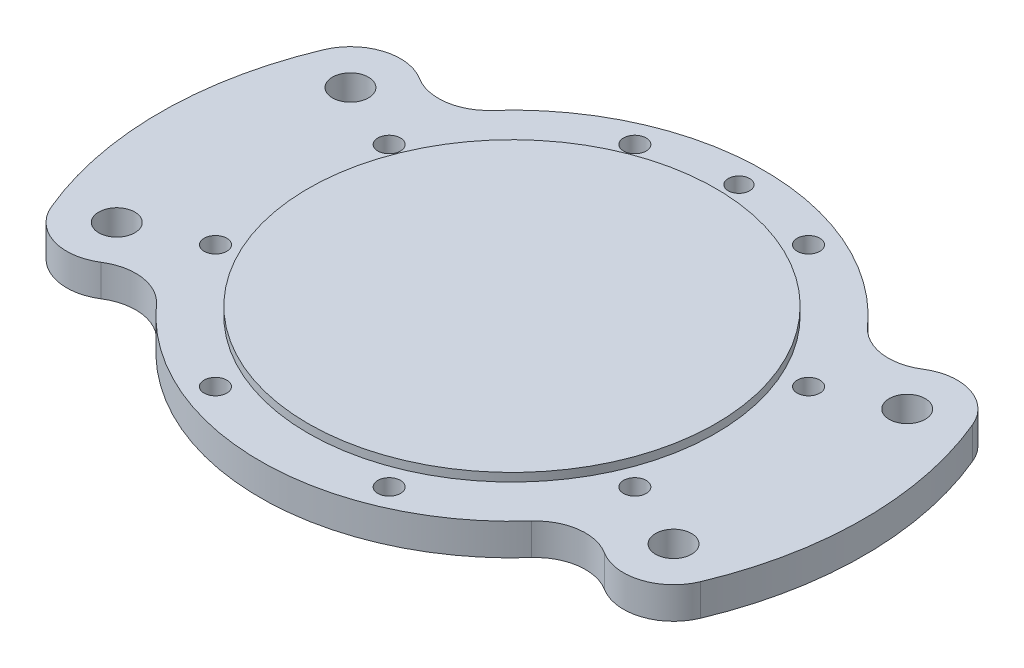
ISO-10303-21;
HEADER;
FILE_DESCRIPTION(('STEP AP214'),'2;1');
FILE_NAME('part.step','',(''),(''),'','','');
FILE_SCHEMA(('AUTOMOTIVE_DESIGN { 1 0 10303 214 1 1 1 1 }'));
ENDSEC;
DATA;
#1=APPLICATION_CONTEXT('core data for automotive mechanical design processes');
#2=APPLICATION_PROTOCOL_DEFINITION('international standard','automotive_design',2000,#1);
#3=PRODUCT_CONTEXT('',#1,'mechanical');
#4=PRODUCT('Part','Part','',(#3));
#5=PRODUCT_RELATED_PRODUCT_CATEGORY('part','',(#4));
#6=PRODUCT_DEFINITION_FORMATION('','',#4);
#7=PRODUCT_DEFINITION_CONTEXT('part definition',#1,'design');
#8=PRODUCT_DEFINITION('design','',#6,#7);
#9=PRODUCT_DEFINITION_SHAPE('','',#8);
#10=(LENGTH_UNIT() NAMED_UNIT(*) SI_UNIT(.MILLI.,.METRE.));
#11=(NAMED_UNIT(*) PLANE_ANGLE_UNIT() SI_UNIT($,.RADIAN.));
#12=(NAMED_UNIT(*) SI_UNIT($,.STERADIAN.) SOLID_ANGLE_UNIT());
#13=UNCERTAINTY_MEASURE_WITH_UNIT(LENGTH_MEASURE(1.E-05),#10,'distance_accuracy_value','');
#14=(GEOMETRIC_REPRESENTATION_CONTEXT(3) GLOBAL_UNCERTAINTY_ASSIGNED_CONTEXT((#13)) GLOBAL_UNIT_ASSIGNED_CONTEXT((#10,
#11,#12)) REPRESENTATION_CONTEXT('',''));
#15=CARTESIAN_POINT('',(0.,0.,0.));
#16=DIRECTION('',(0.,0.,1.));
#17=DIRECTION('',(1.,0.,0.));
#18=AXIS2_PLACEMENT_3D('',#15,#16,#17);
#19=CARTESIAN_POINT('',(0.,6.,0.));
#20=DIRECTION('',(0.,-1.,0.));
#21=DIRECTION('',(0.,0.,-1.));
#22=AXIS2_PLACEMENT_3D('',#19,#20,#21);
#23=CYLINDRICAL_SURFACE('',#22,52.725);
#24=CARTESIAN_POINT('',(0.,4.75,0.));
#25=DIRECTION('',(0.,1.,0.));
#26=DIRECTION('',(0.,0.,1.));
#27=AXIS2_PLACEMENT_3D('',#24,#25,#26);
#28=CIRCLE('',#27,52.725);
#29=CARTESIAN_POINT('',(48.6176681891794,4.75,20.4021558872305));
#30=VERTEX_POINT('',#29);
#31=CARTESIAN_POINT('',(48.6176681891794,4.75,-20.4021558872305));
#32=VERTEX_POINT('',#31);
#33=EDGE_CURVE('E267',#30,#32,#28,.T.);
#34=ORIENTED_EDGE('',*,*,#33,.F.);
#35=DIRECTION('',(0.,-1.,0.));
#36=VECTOR('',#35,1.);
#37=CARTESIAN_POINT('',(48.6176681891794,6.,20.4021558872305));
#38=LINE('',#37,#36);
#39=CARTESIAN_POINT('',(48.6176681891794,0.,20.4021558872305));
#40=VERTEX_POINT('',#39);
#41=EDGE_CURVE('E311',#30,#40,#38,.T.);
#42=ORIENTED_EDGE('',*,*,#41,.T.);
#43=CARTESIAN_POINT('',(0.,0.,0.));
#44=DIRECTION('',(0.,1.,0.));
#45=DIRECTION('',(0.,0.,-1.));
#46=AXIS2_PLACEMENT_3D('',#43,#44,#45);
#47=CIRCLE('',#46,52.725);
#48=CARTESIAN_POINT('',(48.6176681891794,0.,-20.4021558872305));
#49=VERTEX_POINT('',#48);
#50=EDGE_CURVE('E297',#40,#49,#47,.T.);
#51=ORIENTED_EDGE('',*,*,#50,.T.);
#52=DIRECTION('',(0.,-1.,0.));
#53=VECTOR('',#52,1.);
#54=CARTESIAN_POINT('',(48.6176681891794,6.,-20.4021558872305));
#55=LINE('',#54,#53);
#56=EDGE_CURVE('E308',#49,#32,#55,.F.);
#57=ORIENTED_EDGE('',*,*,#56,.T.);
#58=EDGE_LOOP('',(#34,#42,#51,#57));
#59=FACE_BOUND('',#58,.T.);
#60=ADVANCED_FACE('F35',(#59),#23,.T.);
#61=CARTESIAN_POINT('',(0.,6.,0.));
#62=DIRECTION('',(0.,-1.,0.));
#63=DIRECTION('',(0.,0.,-1.));
#64=AXIS2_PLACEMENT_3D('',#61,#62,#63);
#65=CYLINDRICAL_SURFACE('',#64,37.725);
#66=CARTESIAN_POINT('',(0.,4.75,0.));
#67=DIRECTION('',(0.,1.,0.));
#68=DIRECTION('',(0.,0.,1.));
#69=AXIS2_PLACEMENT_3D('',#66,#67,#68);
#70=CIRCLE('',#69,37.725);
#71=CARTESIAN_POINT('',(28.0981033127079,4.75,-25.1728467843506));
#72=VERTEX_POINT('',#71);
#73=CARTESIAN_POINT('',(-28.0981033127079,4.75,-25.1728467843506));
#74=VERTEX_POINT('',#73);
#75=EDGE_CURVE('E141',#72,#74,#70,.T.);
#76=ORIENTED_EDGE('',*,*,#75,.F.);
#77=DIRECTION('',(0.,-1.,0.));
#78=VECTOR('',#77,1.);
#79=CARTESIAN_POINT('',(28.0981033127079,6.,-25.1728467843506));
#80=LINE('',#79,#78);
#81=CARTESIAN_POINT('',(28.0981033127079,0.,-25.1728467843506));
#82=VERTEX_POINT('',#81);
#83=EDGE_CURVE('E158',#72,#82,#80,.T.);
#84=ORIENTED_EDGE('',*,*,#83,.T.);
#85=CARTESIAN_POINT('',(0.,0.,0.));
#86=DIRECTION('',(0.,1.,0.));
#87=DIRECTION('',(0.,0.,-1.));
#88=AXIS2_PLACEMENT_3D('',#85,#86,#87);
#89=CIRCLE('',#88,37.725);
#90=CARTESIAN_POINT('',(-28.0981033127079,0.,-25.1728467843506));
#91=VERTEX_POINT('',#90);
#92=EDGE_CURVE('E300',#82,#91,#89,.T.);
#93=ORIENTED_EDGE('',*,*,#92,.T.);
#94=DIRECTION('',(0.,-1.,0.));
#95=VECTOR('',#94,1.);
#96=CARTESIAN_POINT('',(-28.0981033127079,6.,-25.1728467843506));
#97=LINE('',#96,#95);
#98=EDGE_CURVE('E149',#91,#74,#97,.F.);
#99=ORIENTED_EDGE('',*,*,#98,.T.);
#100=EDGE_LOOP('',(#76,#84,#93,#99));
#101=FACE_BOUND('',#100,.T.);
#102=ADVANCED_FACE('F343',(#101),#65,.T.);
#103=CARTESIAN_POINT('',(0.,6.,0.));
#104=DIRECTION('',(0.,-1.,0.));
#105=DIRECTION('',(0.,0.,-1.));
#106=AXIS2_PLACEMENT_3D('',#103,#104,#105);
#107=CYLINDRICAL_SURFACE('',#106,52.725);
#108=CARTESIAN_POINT('',(0.,4.75,0.));
#109=DIRECTION('',(0.,1.,0.));
#110=DIRECTION('',(0.,0.,1.));
#111=AXIS2_PLACEMENT_3D('',#108,#109,#110);
#112=CIRCLE('',#111,52.725);
#113=CARTESIAN_POINT('',(-48.6176681891794,4.75,-20.4021558872305));
#114=VERTEX_POINT('',#113);
#115=CARTESIAN_POINT('',(-48.6176681891794,4.75,20.4021558872305));
#116=VERTEX_POINT('',#115);
#117=EDGE_CURVE('E126',#114,#116,#112,.T.);
#118=ORIENTED_EDGE('',*,*,#117,.F.);
#119=DIRECTION('',(0.,-1.,0.));
#120=VECTOR('',#119,1.);
#121=CARTESIAN_POINT('',(-48.6176681891794,6.,-20.4021558872305));
#122=LINE('',#121,#120);
#123=CARTESIAN_POINT('',(-48.6176681891794,0.,-20.4021558872305));
#124=VERTEX_POINT('',#123);
#125=EDGE_CURVE('E137',#114,#124,#122,.T.);
#126=ORIENTED_EDGE('',*,*,#125,.T.);
#127=CARTESIAN_POINT('',(0.,0.,0.));
#128=DIRECTION('',(0.,1.,0.));
#129=DIRECTION('',(0.,0.,1.));
#130=AXIS2_PLACEMENT_3D('',#127,#128,#129);
#131=CIRCLE('',#130,52.725);
#132=CARTESIAN_POINT('',(-48.6176681891794,0.,20.4021558872305));
#133=VERTEX_POINT('',#132);
#134=EDGE_CURVE('E303',#124,#133,#131,.T.);
#135=ORIENTED_EDGE('',*,*,#134,.T.);
#136=DIRECTION('',(0.,-1.,0.));
#137=VECTOR('',#136,1.);
#138=CARTESIAN_POINT('',(-48.6176681891794,6.,20.4021558872305));
#139=LINE('',#138,#137);
#140=EDGE_CURVE('E140',#133,#116,#139,.F.);
#141=ORIENTED_EDGE('',*,*,#140,.T.);
#142=EDGE_LOOP('',(#118,#126,#135,#141));
#143=FACE_BOUND('',#142,.T.);
#144=ADVANCED_FACE('F135',(#143),#107,.T.);
#145=CARTESIAN_POINT('',(0.,6.,0.));
#146=DIRECTION('',(0.,-1.,0.));
#147=DIRECTION('',(0.,0.,-1.));
#148=AXIS2_PLACEMENT_3D('',#145,#146,#147);
#149=CYLINDRICAL_SURFACE('',#148,37.725);
#150=CARTESIAN_POINT('',(0.,4.75,0.));
#151=DIRECTION('',(0.,1.,0.));
#152=DIRECTION('',(0.,0.,1.));
#153=AXIS2_PLACEMENT_3D('',#150,#151,#152);
#154=CIRCLE('',#153,37.725);
#155=CARTESIAN_POINT('',(-28.0981033127079,4.75,25.1728467843506));
#156=VERTEX_POINT('',#155);
#157=CARTESIAN_POINT('',(28.0981033127079,4.75,25.1728467843506));
#158=VERTEX_POINT('',#157);
#159=EDGE_CURVE('E260',#156,#158,#154,.T.);
#160=ORIENTED_EDGE('',*,*,#159,.F.);
#161=DIRECTION('',(0.,-1.,0.));
#162=VECTOR('',#161,1.);
#163=CARTESIAN_POINT('',(-28.0981033127079,6.,25.1728467843506));
#164=LINE('',#163,#162);
#165=CARTESIAN_POINT('',(-28.0981033127079,0.,25.1728467843506));
#166=VERTEX_POINT('',#165);
#167=EDGE_CURVE('E152',#156,#166,#164,.T.);
#168=ORIENTED_EDGE('',*,*,#167,.T.);
#169=CARTESIAN_POINT('',(0.,0.,0.));
#170=DIRECTION('',(0.,1.,0.));
#171=DIRECTION('',(0.,0.,1.));
#172=AXIS2_PLACEMENT_3D('',#169,#170,#171);
#173=CIRCLE('',#172,37.725);
#174=CARTESIAN_POINT('',(28.0981033127079,0.,25.1728467843506));
#175=VERTEX_POINT('',#174);
#176=EDGE_CURVE('E305',#166,#175,#173,.T.);
#177=ORIENTED_EDGE('',*,*,#176,.T.);
#178=DIRECTION('',(0.,-1.,0.));
#179=VECTOR('',#178,1.);
#180=CARTESIAN_POINT('',(28.0981033127079,6.,25.1728467843506));
#181=LINE('',#180,#179);
#182=EDGE_CURVE('E147',#175,#158,#181,.F.);
#183=ORIENTED_EDGE('',*,*,#182,.T.);
#184=EDGE_LOOP('',(#160,#168,#177,#183));
#185=FACE_BOUND('',#184,.T.);
#186=ADVANCED_FACE('F324',(#185),#149,.T.);
#187=CARTESIAN_POINT('',(41.7019259147584,6.,-17.5));
#188=DIRECTION('',(0.,-1.,0.));
#189=DIRECTION('',(0.,0.,-1.));
#190=AXIS2_PLACEMENT_3D('',#187,#188,#189);
#191=CYLINDRICAL_SURFACE('',#190,2.7);
#192=CARTESIAN_POINT('',(41.7019259147584,0.,-17.5));
#193=DIRECTION('',(0.,1.,0.));
#194=DIRECTION('',(0.,0.,1.));
#195=AXIS2_PLACEMENT_3D('',#192,#193,#194);
#196=CIRCLE('',#195,2.7);
#197=CARTESIAN_POINT('',(41.7019259147584,0.,-14.8));
#198=VERTEX_POINT('',#197);
#199=EDGE_CURVE('E294',#198,#198,#196,.T.);
#200=ORIENTED_EDGE('',*,*,#199,.F.);
#201=EDGE_LOOP('',(#200));
#202=FACE_BOUND('',#201,.T.);
#203=CARTESIAN_POINT('',(41.7019259147584,4.75,-17.5));
#204=DIRECTION('',(0.,1.,0.));
#205=DIRECTION('',(0.,0.,1.));
#206=AXIS2_PLACEMENT_3D('',#203,#204,#205);
#207=CIRCLE('',#206,2.7);
#208=CARTESIAN_POINT('',(41.7019259147584,4.75,-14.8));
#209=VERTEX_POINT('',#208);
#210=EDGE_CURVE('E281',#209,#209,#207,.T.);
#211=ORIENTED_EDGE('',*,*,#210,.T.);
#212=EDGE_LOOP('',(#211));
#213=FACE_BOUND('',#212,.T.);
#214=ADVANCED_FACE('F385',(#202,#213),#191,.F.);
#215=CARTESIAN_POINT('',(41.7019259147584,6.,17.5));
#216=DIRECTION('',(0.,-1.,0.));
#217=DIRECTION('',(0.,0.,-1.));
#218=AXIS2_PLACEMENT_3D('',#215,#216,#217);
#219=CYLINDRICAL_SURFACE('',#218,2.7);
#220=CARTESIAN_POINT('',(41.7019259147584,0.,17.5));
#221=DIRECTION('',(0.,1.,0.));
#222=DIRECTION('',(0.,0.,1.));
#223=AXIS2_PLACEMENT_3D('',#220,#221,#222);
#224=CIRCLE('',#223,2.7);
#225=CARTESIAN_POINT('',(41.7019259147584,0.,20.2));
#226=VERTEX_POINT('',#225);
#227=EDGE_CURVE('E291',#226,#226,#224,.T.);
#228=ORIENTED_EDGE('',*,*,#227,.F.);
#229=EDGE_LOOP('',(#228));
#230=FACE_BOUND('',#229,.T.);
#231=CARTESIAN_POINT('',(41.7019259147584,4.75,17.5));
#232=DIRECTION('',(0.,1.,0.));
#233=DIRECTION('',(0.,0.,1.));
#234=AXIS2_PLACEMENT_3D('',#231,#232,#233);
#235=CIRCLE('',#234,2.7);
#236=CARTESIAN_POINT('',(41.7019259147584,4.75,20.2));
#237=VERTEX_POINT('',#236);
#238=EDGE_CURVE('E278',#237,#237,#235,.T.);
#239=ORIENTED_EDGE('',*,*,#238,.T.);
#240=EDGE_LOOP('',(#239));
#241=FACE_BOUND('',#240,.T.);
#242=ADVANCED_FACE('F398',(#230,#241),#219,.F.);
#243=CARTESIAN_POINT('',(-41.7019259147584,6.,-17.5));
#244=DIRECTION('',(0.,-1.,0.));
#245=DIRECTION('',(0.,0.,-1.));
#246=AXIS2_PLACEMENT_3D('',#243,#244,#245);
#247=CYLINDRICAL_SURFACE('',#246,2.7);
#248=CARTESIAN_POINT('',(-41.7019259147584,0.,-17.5));
#249=DIRECTION('',(0.,1.,0.));
#250=DIRECTION('',(0.,0.,-1.));
#251=AXIS2_PLACEMENT_3D('',#248,#249,#250);
#252=CIRCLE('',#251,2.7);
#253=CARTESIAN_POINT('',(-41.7019259147584,0.,-20.2));
#254=VERTEX_POINT('',#253);
#255=EDGE_CURVE('E288',#254,#254,#252,.T.);
#256=ORIENTED_EDGE('',*,*,#255,.F.);
#257=EDGE_LOOP('',(#256));
#258=FACE_BOUND('',#257,.T.);
#259=CARTESIAN_POINT('',(-41.7019259147584,4.75,-17.5));
#260=DIRECTION('',(0.,1.,0.));
#261=DIRECTION('',(0.,0.,1.));
#262=AXIS2_PLACEMENT_3D('',#259,#260,#261);
#263=CIRCLE('',#262,2.7);
#264=CARTESIAN_POINT('',(-41.7019259147584,4.75,-14.8));
#265=VERTEX_POINT('',#264);
#266=EDGE_CURVE('E275',#265,#265,#263,.T.);
#267=ORIENTED_EDGE('',*,*,#266,.T.);
#268=EDGE_LOOP('',(#267));
#269=FACE_BOUND('',#268,.T.);
#270=ADVANCED_FACE('F370',(#258,#269),#247,.F.);
#271=CARTESIAN_POINT('',(-41.7019259147584,6.,17.5));
#272=DIRECTION('',(0.,-1.,0.));
#273=DIRECTION('',(0.,0.,-1.));
#274=AXIS2_PLACEMENT_3D('',#271,#272,#273);
#275=CYLINDRICAL_SURFACE('',#274,2.7);
#276=CARTESIAN_POINT('',(-41.7019259147584,0.,17.5));
#277=DIRECTION('',(0.,1.,0.));
#278=DIRECTION('',(0.,0.,-1.));
#279=AXIS2_PLACEMENT_3D('',#276,#277,#278);
#280=CIRCLE('',#279,2.7);
#281=CARTESIAN_POINT('',(-41.7019259147584,0.,14.8));
#282=VERTEX_POINT('',#281);
#283=EDGE_CURVE('E167',#282,#282,#280,.T.);
#284=ORIENTED_EDGE('',*,*,#283,.F.);
#285=EDGE_LOOP('',(#284));
#286=FACE_BOUND('',#285,.T.);
#287=CARTESIAN_POINT('',(-41.7019259147584,4.75,17.5));
#288=DIRECTION('',(0.,1.,0.));
#289=DIRECTION('',(0.,0.,1.));
#290=AXIS2_PLACEMENT_3D('',#287,#288,#289);
#291=CIRCLE('',#290,2.7);
#292=CARTESIAN_POINT('',(-41.7019259147584,4.75,20.2));
#293=VERTEX_POINT('',#292);
#294=EDGE_CURVE('E272',#293,#293,#291,.T.);
#295=ORIENTED_EDGE('',*,*,#294,.T.);
#296=EDGE_LOOP('',(#295));
#297=FACE_BOUND('',#296,.T.);
#298=ADVANCED_FACE('F363',(#286,#297),#275,.F.);
#299=CARTESIAN_POINT('',(33.6842073510197,6.,30.1773888885953));
#300=DIRECTION('',(0.,-1.,0.));
#301=DIRECTION('',(0.,0.,-1.));
#302=AXIS2_PLACEMENT_3D('',#299,#300,#301);
#303=CYLINDRICAL_SURFACE('',#302,7.5);
#304=CARTESIAN_POINT('',(33.6842073510197,4.75,30.1773888885953));
#305=DIRECTION('',(0.,1.,0.));
#306=DIRECTION('',(0.,0.,1.));
#307=AXIS2_PLACEMENT_3D('',#304,#305,#306);
#308=CIRCLE('',#307,7.5);
#309=CARTESIAN_POINT('',(37.693066632889,4.75,23.8386944442976));
#310=VERTEX_POINT('',#309);
#311=EDGE_CURVE('E265',#158,#310,#308,.F.);
#312=ORIENTED_EDGE('',*,*,#311,.F.);
#313=ORIENTED_EDGE('',*,*,#182,.F.);
#314=CARTESIAN_POINT('',(33.6842073510197,0.,30.1773888885953));
#315=DIRECTION('',(0.,-1.,0.));
#316=DIRECTION('',(0.,0.,-1.));
#317=AXIS2_PLACEMENT_3D('',#314,#315,#316);
#318=CIRCLE('',#317,7.5);
#319=CARTESIAN_POINT('',(37.693066632889,0.,23.8386944442976));
#320=VERTEX_POINT('',#319);
#321=EDGE_CURVE('E160',#320,#175,#318,.F.);
#322=ORIENTED_EDGE('',*,*,#321,.F.);
#323=DIRECTION('',(0.,1.,0.));
#324=VECTOR('',#323,1.);
#325=CARTESIAN_POINT('',(37.693066632889,0.,23.8386944442976));
#326=LINE('',#325,#324);
#327=EDGE_CURVE('E165',#310,#320,#326,.F.);
#328=ORIENTED_EDGE('',*,*,#327,.F.);
#329=EDGE_LOOP('',(#312,#313,#322,#328));
#330=FACE_BOUND('',#329,.T.);
#331=ADVANCED_FACE('F361',(#330),#303,.F.);
#332=CARTESIAN_POINT('',(41.7019259147584,6.,17.5));
#333=DIRECTION('',(0.,-1.,0.));
#334=DIRECTION('',(0.,0.,-1.));
#335=AXIS2_PLACEMENT_3D('',#332,#333,#334);
#336=CYLINDRICAL_SURFACE('',#335,7.5);
#337=ORIENTED_EDGE('',*,*,#41,.F.);
#338=CARTESIAN_POINT('',(41.7019259147584,4.75,17.5));
#339=DIRECTION('',(0.,1.,0.));
#340=DIRECTION('',(0.,0.,1.));
#341=AXIS2_PLACEMENT_3D('',#338,#339,#340);
#342=CIRCLE('',#341,7.5);
#343=EDGE_CURVE('E269',#30,#310,#342,.F.);
#344=ORIENTED_EDGE('',*,*,#343,.T.);
#345=ORIENTED_EDGE('',*,*,#327,.T.);
#346=CARTESIAN_POINT('',(41.7019259147584,0.,17.5));
#347=DIRECTION('',(0.,-1.,0.));
#348=DIRECTION('',(0.,0.,-1.));
#349=AXIS2_PLACEMENT_3D('',#346,#347,#348);
#350=CIRCLE('',#349,7.5);
#351=EDGE_CURVE('E318',#40,#320,#350,.T.);
#352=ORIENTED_EDGE('',*,*,#351,.F.);
#353=EDGE_LOOP('',(#337,#344,#345,#352));
#354=FACE_BOUND('',#353,.T.);
#355=ADVANCED_FACE('F357',(#354),#336,.T.);
#356=CARTESIAN_POINT('',(-33.6842073510197,6.,30.1773888885953));
#357=DIRECTION('',(0.,-1.,0.));
#358=DIRECTION('',(0.,0.,-1.));
#359=AXIS2_PLACEMENT_3D('',#356,#357,#358);
#360=CYLINDRICAL_SURFACE('',#359,7.5);
#361=CARTESIAN_POINT('',(-33.6842073510197,4.75,30.1773888885953));
#362=DIRECTION('',(0.,1.,0.));
#363=DIRECTION('',(0.,0.,1.));
#364=AXIS2_PLACEMENT_3D('',#361,#362,#363);
#365=CIRCLE('',#364,7.5);
#366=CARTESIAN_POINT('',(-37.693066632889,4.75,23.8386944442976));
#367=VERTEX_POINT('',#366);
#368=EDGE_CURVE('E258',#367,#156,#365,.F.);
#369=ORIENTED_EDGE('',*,*,#368,.F.);
#370=DIRECTION('',(0.,1.,0.));
#371=VECTOR('',#370,1.);
#372=CARTESIAN_POINT('',(-37.693066632889,6.,23.8386944442976));
#373=LINE('',#372,#371);
#374=CARTESIAN_POINT('',(-37.693066632889,0.,23.8386944442976));
#375=VERTEX_POINT('',#374);
#376=EDGE_CURVE('E168',#375,#367,#373,.T.);
#377=ORIENTED_EDGE('',*,*,#376,.F.);
#378=CARTESIAN_POINT('',(-33.6842073510197,0.,30.1773888885953));
#379=DIRECTION('',(0.,-1.,0.));
#380=DIRECTION('',(0.,0.,-1.));
#381=AXIS2_PLACEMENT_3D('',#378,#379,#380);
#382=CIRCLE('',#381,7.5);
#383=EDGE_CURVE('E162',#166,#375,#382,.F.);
#384=ORIENTED_EDGE('',*,*,#383,.F.);
#385=ORIENTED_EDGE('',*,*,#167,.F.);
#386=EDGE_LOOP('',(#369,#377,#384,#385));
#387=FACE_BOUND('',#386,.T.);
#388=ADVANCED_FACE('F334',(#387),#360,.F.);
#389=CARTESIAN_POINT('',(-41.7019259147584,6.,17.5));
#390=DIRECTION('',(0.,-1.,0.));
#391=DIRECTION('',(0.,0.,-1.));
#392=AXIS2_PLACEMENT_3D('',#389,#390,#391);
#393=CYLINDRICAL_SURFACE('',#392,7.5);
#394=ORIENTED_EDGE('',*,*,#376,.T.);
#395=CARTESIAN_POINT('',(-41.7019259147584,4.75,17.5));
#396=DIRECTION('',(0.,1.,0.));
#397=DIRECTION('',(0.,0.,1.));
#398=AXIS2_PLACEMENT_3D('',#395,#396,#397);
#399=CIRCLE('',#398,7.5);
#400=EDGE_CURVE('E256',#367,#116,#399,.F.);
#401=ORIENTED_EDGE('',*,*,#400,.T.);
#402=ORIENTED_EDGE('',*,*,#140,.F.);
#403=CARTESIAN_POINT('',(-41.7019259147584,0.,17.5));
#404=DIRECTION('',(0.,-1.,0.));
#405=DIRECTION('',(0.,0.,-1.));
#406=AXIS2_PLACEMENT_3D('',#403,#404,#405);
#407=CIRCLE('',#406,7.5);
#408=EDGE_CURVE('E316',#375,#133,#407,.T.);
#409=ORIENTED_EDGE('',*,*,#408,.F.);
#410=EDGE_LOOP('',(#394,#401,#402,#409));
#411=FACE_BOUND('',#410,.T.);
#412=ADVANCED_FACE('F337',(#411),#393,.T.);
#413=CARTESIAN_POINT('',(33.6842073510197,6.,-30.1773888885953));
#414=DIRECTION('',(0.,-1.,0.));
#415=DIRECTION('',(0.,0.,-1.));
#416=AXIS2_PLACEMENT_3D('',#413,#414,#415);
#417=CYLINDRICAL_SURFACE('',#416,7.5);
#418=CARTESIAN_POINT('',(33.6842073510197,4.75,-30.1773888885953));
#419=DIRECTION('',(0.,1.,0.));
#420=DIRECTION('',(0.,0.,1.));
#421=AXIS2_PLACEMENT_3D('',#418,#419,#420);
#422=CIRCLE('',#421,7.5);
#423=CARTESIAN_POINT('',(37.693066632889,4.75,-23.8386944442976));
#424=VERTEX_POINT('',#423);
#425=EDGE_CURVE('E254',#424,#72,#422,.F.);
#426=ORIENTED_EDGE('',*,*,#425,.F.);
#427=DIRECTION('',(0.,1.,0.));
#428=VECTOR('',#427,1.);
#429=CARTESIAN_POINT('',(37.693066632889,6.,-23.8386944442976));
#430=LINE('',#429,#428);
#431=CARTESIAN_POINT('',(37.693066632889,0.,-23.8386944442976));
#432=VERTEX_POINT('',#431);
#433=EDGE_CURVE('E171',#432,#424,#430,.T.);
#434=ORIENTED_EDGE('',*,*,#433,.F.);
#435=CARTESIAN_POINT('',(33.6842073510197,0.,-30.1773888885953));
#436=DIRECTION('',(0.,-1.,0.));
#437=DIRECTION('',(0.,0.,-1.));
#438=AXIS2_PLACEMENT_3D('',#435,#436,#437);
#439=CIRCLE('',#438,7.5);
#440=EDGE_CURVE('E44',#82,#432,#439,.F.);
#441=ORIENTED_EDGE('',*,*,#440,.F.);
#442=ORIENTED_EDGE('',*,*,#83,.F.);
#443=EDGE_LOOP('',(#426,#434,#441,#442));
#444=FACE_BOUND('',#443,.T.);
#445=ADVANCED_FACE('F347',(#444),#417,.F.);
#446=CARTESIAN_POINT('',(41.7019259147584,6.,-17.5));
#447=DIRECTION('',(0.,-1.,0.));
#448=DIRECTION('',(0.,0.,-1.));
#449=AXIS2_PLACEMENT_3D('',#446,#447,#448);
#450=CYLINDRICAL_SURFACE('',#449,7.5);
#451=ORIENTED_EDGE('',*,*,#433,.T.);
#452=CARTESIAN_POINT('',(41.7019259147584,4.75,-17.5));
#453=DIRECTION('',(0.,1.,0.));
#454=DIRECTION('',(0.,0.,1.));
#455=AXIS2_PLACEMENT_3D('',#452,#453,#454);
#456=CIRCLE('',#455,7.5);
#457=EDGE_CURVE('E262',#424,#32,#456,.F.);
#458=ORIENTED_EDGE('',*,*,#457,.T.);
#459=ORIENTED_EDGE('',*,*,#56,.F.);
#460=CARTESIAN_POINT('',(41.7019259147584,0.,-17.5));
#461=DIRECTION('',(0.,-1.,0.));
#462=DIRECTION('',(0.,0.,-1.));
#463=AXIS2_PLACEMENT_3D('',#460,#461,#462);
#464=CIRCLE('',#463,7.5);
#465=EDGE_CURVE('E314',#432,#49,#464,.T.);
#466=ORIENTED_EDGE('',*,*,#465,.F.);
#467=EDGE_LOOP('',(#451,#458,#459,#466));
#468=FACE_BOUND('',#467,.T.);
#469=ADVANCED_FACE('F351',(#468),#450,.T.);
#470=CARTESIAN_POINT('',(-33.6842073510197,6.,-30.1773888885953));
#471=DIRECTION('',(0.,-1.,0.));
#472=DIRECTION('',(0.,0.,-1.));
#473=AXIS2_PLACEMENT_3D('',#470,#471,#472);
#474=CYLINDRICAL_SURFACE('',#473,7.5);
#475=CARTESIAN_POINT('',(-33.6842073510197,4.75,-30.1773888885953));
#476=DIRECTION('',(0.,1.,0.));
#477=DIRECTION('',(0.,0.,1.));
#478=AXIS2_PLACEMENT_3D('',#475,#476,#477);
#479=CIRCLE('',#478,7.5);
#480=CARTESIAN_POINT('',(-37.693066632889,4.75,-23.8386944442976));
#481=VERTEX_POINT('',#480);
#482=EDGE_CURVE('E52',#74,#481,#479,.F.);
#483=ORIENTED_EDGE('',*,*,#482,.F.);
#484=ORIENTED_EDGE('',*,*,#98,.F.);
#485=CARTESIAN_POINT('',(-33.6842073510197,0.,-30.1773888885953));
#486=DIRECTION('',(0.,-1.,0.));
#487=DIRECTION('',(0.,0.,-1.));
#488=AXIS2_PLACEMENT_3D('',#485,#486,#487);
#489=CIRCLE('',#488,7.5);
#490=CARTESIAN_POINT('',(-37.693066632889,0.,-23.8386944442976));
#491=VERTEX_POINT('',#490);
#492=EDGE_CURVE('E12',#491,#91,#489,.F.);
#493=ORIENTED_EDGE('',*,*,#492,.F.);
#494=DIRECTION('',(0.,1.,0.));
#495=VECTOR('',#494,1.);
#496=CARTESIAN_POINT('',(-37.693066632889,0.,-23.8386944442976));
#497=LINE('',#496,#495);
#498=EDGE_CURVE('E174',#481,#491,#497,.F.);
#499=ORIENTED_EDGE('',*,*,#498,.F.);
#500=EDGE_LOOP('',(#483,#484,#493,#499));
#501=FACE_BOUND('',#500,.T.);
#502=ADVANCED_FACE('F37',(#501),#474,.F.);
#503=CARTESIAN_POINT('',(-41.7019259147584,6.,-17.5));
#504=DIRECTION('',(0.,-1.,0.));
#505=DIRECTION('',(0.,0.,-1.));
#506=AXIS2_PLACEMENT_3D('',#503,#504,#505);
#507=CYLINDRICAL_SURFACE('',#506,7.5);
#508=ORIENTED_EDGE('',*,*,#125,.F.);
#509=CARTESIAN_POINT('',(-41.7019259147584,4.75,-17.5));
#510=DIRECTION('',(0.,1.,0.));
#511=DIRECTION('',(0.,0.,1.));
#512=AXIS2_PLACEMENT_3D('',#509,#510,#511);
#513=CIRCLE('',#512,7.5);
#514=EDGE_CURVE('E122',#114,#481,#513,.F.);
#515=ORIENTED_EDGE('',*,*,#514,.T.);
#516=ORIENTED_EDGE('',*,*,#498,.T.);
#517=CARTESIAN_POINT('',(-41.7019259147584,0.,-17.5));
#518=DIRECTION('',(0.,-1.,0.));
#519=DIRECTION('',(0.,0.,-1.));
#520=AXIS2_PLACEMENT_3D('',#517,#518,#519);
#521=CIRCLE('',#520,7.5);
#522=EDGE_CURVE('E145',#124,#491,#521,.T.);
#523=ORIENTED_EDGE('',*,*,#522,.F.);
#524=EDGE_LOOP('',(#508,#515,#516,#523));
#525=FACE_BOUND('',#524,.T.);
#526=ADVANCED_FACE('F143',(#525),#507,.T.);
#527=CARTESIAN_POINT('',(0.,0.,-34.));
#528=DIRECTION('',(0.,1.,0.));
#529=DIRECTION('',(0.,0.,1.));
#530=AXIS2_PLACEMENT_3D('',#527,#528,#529);
#531=CYLINDRICAL_SURFACE('',#530,1.6);
#532=CARTESIAN_POINT('',(0.,0.,-34.));
#533=DIRECTION('',(0.,1.,0.));
#534=DIRECTION('',(0.,0.,1.));
#535=AXIS2_PLACEMENT_3D('',#532,#533,#534);
#536=CIRCLE('',#535,1.6);
#537=CARTESIAN_POINT('',(0.,0.,-32.4));
#538=VERTEX_POINT('',#537);
#539=EDGE_CURVE('E176',#538,#538,#536,.T.);
#540=ORIENTED_EDGE('',*,*,#539,.F.);
#541=EDGE_LOOP('',(#540));
#542=FACE_BOUND('',#541,.T.);
#543=CARTESIAN_POINT('',(0.,4.75,-34.));
#544=DIRECTION('',(0.,1.,0.));
#545=DIRECTION('',(0.,0.,1.));
#546=AXIS2_PLACEMENT_3D('',#543,#544,#545);
#547=CIRCLE('',#546,1.6);
#548=CARTESIAN_POINT('',(0.,4.75,-32.4));
#549=VERTEX_POINT('',#548);
#550=EDGE_CURVE('E131',#549,#549,#547,.F.);
#551=ORIENTED_EDGE('',*,*,#550,.F.);
#552=EDGE_LOOP('',(#551));
#553=FACE_BOUND('',#552,.T.);
#554=ADVANCED_FACE('F388',(#542,#553),#531,.F.);
#555=CARTESIAN_POINT('',(0.,0.,0.));
#556=DIRECTION('',(0.,-1.,0.));
#557=DIRECTION('',(0.,0.,-1.));
#558=AXIS2_PLACEMENT_3D('',#555,#556,#557);
#559=PLANE('',#558);
#560=CARTESIAN_POINT('',(-13.011236700413,0.,31.4119041053838));
#561=DIRECTION('',(0.,-1.,0.));
#562=DIRECTION('',(0.,0.,-1.));
#563=AXIS2_PLACEMENT_3D('',#560,#561,#562);
#564=CIRCLE('',#563,3.15);
#565=CARTESIAN_POINT('',(-13.011236700413,0.,28.2619041053838));
#566=VERTEX_POINT('',#565);
#567=EDGE_CURVE('E484',#566,#566,#564,.T.);
#568=ORIENTED_EDGE('',*,*,#567,.F.);
#569=EDGE_LOOP('',(#568));
#570=FACE_BOUND('',#569,.T.);
#571=CARTESIAN_POINT('',(13.0112367004131,0.,31.4119041053837));
#572=DIRECTION('',(0.,-1.,0.));
#573=DIRECTION('',(0.,0.,-1.));
#574=AXIS2_PLACEMENT_3D('',#571,#572,#573);
#575=CIRCLE('',#574,3.15);
#576=CARTESIAN_POINT('',(13.0112367004131,0.,28.2619041053837));
#577=VERTEX_POINT('',#576);
#578=EDGE_CURVE('E218',#577,#577,#575,.T.);
#579=ORIENTED_EDGE('',*,*,#578,.F.);
#580=EDGE_LOOP('',(#579));
#581=FACE_BOUND('',#580,.T.);
#582=CARTESIAN_POINT('',(31.4119041053838,0.,13.011236700413));
#583=DIRECTION('',(0.,-1.,0.));
#584=DIRECTION('',(0.,0.,-1.));
#585=AXIS2_PLACEMENT_3D('',#582,#583,#584);
#586=CIRCLE('',#585,3.15);
#587=CARTESIAN_POINT('',(31.4119041053838,0.,9.86123670041302));
#588=VERTEX_POINT('',#587);
#589=EDGE_CURVE('E211',#588,#588,#586,.T.);
#590=ORIENTED_EDGE('',*,*,#589,.F.);
#591=EDGE_LOOP('',(#590));
#592=FACE_BOUND('',#591,.T.);
#593=CARTESIAN_POINT('',(31.4119041053837,0.,-13.0112367004131));
#594=DIRECTION('',(0.,-1.,0.));
#595=DIRECTION('',(0.,0.,-1.));
#596=AXIS2_PLACEMENT_3D('',#593,#594,#595);
#597=CIRCLE('',#596,3.15);
#598=CARTESIAN_POINT('',(31.4119041053837,0.,-16.1612367004131));
#599=VERTEX_POINT('',#598);
#600=EDGE_CURVE('E207',#599,#599,#597,.T.);
#601=ORIENTED_EDGE('',*,*,#600,.F.);
#602=EDGE_LOOP('',(#601));
#603=FACE_BOUND('',#602,.T.);
#604=CARTESIAN_POINT('',(13.011236700413,0.,-31.4119041053838));
#605=DIRECTION('',(0.,-1.,0.));
#606=DIRECTION('',(0.,0.,-1.));
#607=AXIS2_PLACEMENT_3D('',#604,#605,#606);
#608=CIRCLE('',#607,3.15);
#609=CARTESIAN_POINT('',(13.011236700413,0.,-34.5619041053838));
#610=VERTEX_POINT('',#609);
#611=EDGE_CURVE('E203',#610,#610,#608,.T.);
#612=ORIENTED_EDGE('',*,*,#611,.F.);
#613=EDGE_LOOP('',(#612));
#614=FACE_BOUND('',#613,.T.);
#615=CARTESIAN_POINT('',(-13.0112367004131,0.,-31.4119041053837));
#616=DIRECTION('',(0.,-1.,0.));
#617=DIRECTION('',(0.,0.,-1.));
#618=AXIS2_PLACEMENT_3D('',#615,#616,#617);
#619=CIRCLE('',#618,3.15);
#620=CARTESIAN_POINT('',(-13.0112367004131,0.,-34.5619041053837));
#621=VERTEX_POINT('',#620);
#622=EDGE_CURVE('E198',#621,#621,#619,.T.);
#623=ORIENTED_EDGE('',*,*,#622,.F.);
#624=EDGE_LOOP('',(#623));
#625=FACE_BOUND('',#624,.T.);
#626=CARTESIAN_POINT('',(-31.4119041053838,0.,-13.011236700413));
#627=DIRECTION('',(0.,-1.,0.));
#628=DIRECTION('',(0.,0.,-1.));
#629=AXIS2_PLACEMENT_3D('',#626,#627,#628);
#630=CIRCLE('',#629,3.15);
#631=CARTESIAN_POINT('',(-31.4119041053838,0.,-16.161236700413));
#632=VERTEX_POINT('',#631);
#633=EDGE_CURVE('E193',#632,#632,#630,.T.);
#634=ORIENTED_EDGE('',*,*,#633,.F.);
#635=EDGE_LOOP('',(#634));
#636=FACE_BOUND('',#635,.T.);
#637=CARTESIAN_POINT('',(-31.4119041053837,0.,13.0112367004131));
#638=DIRECTION('',(0.,-1.,0.));
#639=DIRECTION('',(0.,0.,-1.));
#640=AXIS2_PLACEMENT_3D('',#637,#638,#639);
#641=CIRCLE('',#640,3.15);
#642=CARTESIAN_POINT('',(-31.4119041053837,0.,9.86123670041309));
#643=VERTEX_POINT('',#642);
#644=EDGE_CURVE('E188',#643,#643,#641,.T.);
#645=ORIENTED_EDGE('',*,*,#644,.F.);
#646=EDGE_LOOP('',(#645));
#647=FACE_BOUND('',#646,.T.);
#648=ORIENTED_EDGE('',*,*,#539,.T.);
#649=EDGE_LOOP('',(#648));
#650=FACE_BOUND('',#649,.T.);
#651=ORIENTED_EDGE('',*,*,#255,.T.);
#652=EDGE_LOOP('',(#651));
#653=FACE_BOUND('',#652,.T.);
#654=ORIENTED_EDGE('',*,*,#50,.F.);
#655=ORIENTED_EDGE('',*,*,#351,.T.);
#656=ORIENTED_EDGE('',*,*,#321,.T.);
#657=ORIENTED_EDGE('',*,*,#176,.F.);
#658=ORIENTED_EDGE('',*,*,#383,.T.);
#659=ORIENTED_EDGE('',*,*,#408,.T.);
#660=ORIENTED_EDGE('',*,*,#134,.F.);
#661=ORIENTED_EDGE('',*,*,#522,.T.);
#662=ORIENTED_EDGE('',*,*,#492,.T.);
#663=ORIENTED_EDGE('',*,*,#92,.F.);
#664=ORIENTED_EDGE('',*,*,#440,.T.);
#665=ORIENTED_EDGE('',*,*,#465,.T.);
#666=EDGE_LOOP('',(#654,#655,#656,#657,#658,#659,#660,#661,#662,#663,#664,#665));
#667=FACE_BOUND('',#666,.T.);
#668=ORIENTED_EDGE('',*,*,#199,.T.);
#669=EDGE_LOOP('',(#668));
#670=FACE_BOUND('',#669,.T.);
#671=ORIENTED_EDGE('',*,*,#227,.T.);
#672=EDGE_LOOP('',(#671));
#673=FACE_BOUND('',#672,.T.);
#674=ORIENTED_EDGE('',*,*,#283,.T.);
#675=EDGE_LOOP('',(#674));
#676=FACE_BOUND('',#675,.T.);
#677=ADVANCED_FACE('F330',(#570,#581,#592,#603,#614,#625,#636,#647,#650,#653,#667,#670,#673,
#676),#559,.T.);
#678=CARTESIAN_POINT('',(0.,4.75,0.));
#679=DIRECTION('',(0.,1.,0.));
#680=DIRECTION('',(0.,0.,1.));
#681=AXIS2_PLACEMENT_3D('',#678,#679,#680);
#682=PLANE('',#681);
#683=CARTESIAN_POINT('',(-13.011236700413,4.75,31.4119041053838));
#684=DIRECTION('',(0.,1.,0.));
#685=DIRECTION('',(0.,0.,1.));
#686=AXIS2_PLACEMENT_3D('',#683,#684,#685);
#687=CIRCLE('',#686,1.7);
#688=CARTESIAN_POINT('',(-13.011236700413,4.75,33.1119041053838));
#689=VERTEX_POINT('',#688);
#690=EDGE_CURVE('E39',#689,#689,#687,.T.);
#691=ORIENTED_EDGE('',*,*,#690,.F.);
#692=EDGE_LOOP('',(#691));
#693=FACE_BOUND('',#692,.T.);
#694=CARTESIAN_POINT('',(13.0112367004131,4.75,31.4119041053837));
#695=DIRECTION('',(0.,1.,0.));
#696=DIRECTION('',(0.,0.,1.));
#697=AXIS2_PLACEMENT_3D('',#694,#695,#696);
#698=CIRCLE('',#697,1.7);
#699=CARTESIAN_POINT('',(13.0112367004131,4.75,33.1119041053837));
#700=VERTEX_POINT('',#699);
#701=EDGE_CURVE('E209',#700,#700,#698,.T.);
#702=ORIENTED_EDGE('',*,*,#701,.F.);
#703=EDGE_LOOP('',(#702));
#704=FACE_BOUND('',#703,.T.);
#705=CARTESIAN_POINT('',(31.4119041053838,4.75,13.011236700413));
#706=DIRECTION('',(0.,1.,0.));
#707=DIRECTION('',(0.,0.,1.));
#708=AXIS2_PLACEMENT_3D('',#705,#706,#707);
#709=CIRCLE('',#708,1.7);
#710=CARTESIAN_POINT('',(31.4119041053838,4.75,14.711236700413));
#711=VERTEX_POINT('',#710);
#712=EDGE_CURVE('E205',#711,#711,#709,.T.);
#713=ORIENTED_EDGE('',*,*,#712,.F.);
#714=EDGE_LOOP('',(#713));
#715=FACE_BOUND('',#714,.T.);
#716=CARTESIAN_POINT('',(31.4119041053837,4.75,-13.0112367004131));
#717=DIRECTION('',(0.,1.,0.));
#718=DIRECTION('',(0.,0.,1.));
#719=AXIS2_PLACEMENT_3D('',#716,#717,#718);
#720=CIRCLE('',#719,1.7);
#721=CARTESIAN_POINT('',(31.4119041053837,4.75,-11.3112367004131));
#722=VERTEX_POINT('',#721);
#723=EDGE_CURVE('E200',#722,#722,#720,.T.);
#724=ORIENTED_EDGE('',*,*,#723,.F.);
#725=EDGE_LOOP('',(#724));
#726=FACE_BOUND('',#725,.T.);
#727=CARTESIAN_POINT('',(13.011236700413,4.75,-31.4119041053838));
#728=DIRECTION('',(0.,1.,0.));
#729=DIRECTION('',(0.,0.,1.));
#730=AXIS2_PLACEMENT_3D('',#727,#728,#729);
#731=CIRCLE('',#730,1.7);
#732=CARTESIAN_POINT('',(13.011236700413,4.75,-29.7119041053838));
#733=VERTEX_POINT('',#732);
#734=EDGE_CURVE('E195',#733,#733,#731,.T.);
#735=ORIENTED_EDGE('',*,*,#734,.F.);
#736=EDGE_LOOP('',(#735));
#737=FACE_BOUND('',#736,.T.);
#738=CARTESIAN_POINT('',(-13.0112367004131,4.75,-31.4119041053837));
#739=DIRECTION('',(0.,1.,0.));
#740=DIRECTION('',(0.,0.,1.));
#741=AXIS2_PLACEMENT_3D('',#738,#739,#740);
#742=CIRCLE('',#741,1.7);
#743=CARTESIAN_POINT('',(-13.0112367004131,4.75,-29.7119041053837));
#744=VERTEX_POINT('',#743);
#745=EDGE_CURVE('E190',#744,#744,#742,.T.);
#746=ORIENTED_EDGE('',*,*,#745,.F.);
#747=EDGE_LOOP('',(#746));
#748=FACE_BOUND('',#747,.T.);
#749=CARTESIAN_POINT('',(-31.4119041053838,4.75,-13.011236700413));
#750=DIRECTION('',(0.,1.,0.));
#751=DIRECTION('',(0.,0.,1.));
#752=AXIS2_PLACEMENT_3D('',#749,#750,#751);
#753=CIRCLE('',#752,1.7);
#754=CARTESIAN_POINT('',(-31.4119041053838,4.75,-11.311236700413));
#755=VERTEX_POINT('',#754);
#756=EDGE_CURVE('E185',#755,#755,#753,.T.);
#757=ORIENTED_EDGE('',*,*,#756,.F.);
#758=EDGE_LOOP('',(#757));
#759=FACE_BOUND('',#758,.T.);
#760=CARTESIAN_POINT('',(-31.4119041053837,4.75,13.0112367004131));
#761=DIRECTION('',(0.,1.,0.));
#762=DIRECTION('',(0.,0.,1.));
#763=AXIS2_PLACEMENT_3D('',#760,#761,#762);
#764=CIRCLE('',#763,1.7);
#765=CARTESIAN_POINT('',(-31.4119041053837,4.75,14.7112367004131));
#766=VERTEX_POINT('',#765);
#767=EDGE_CURVE('E180',#766,#766,#764,.T.);
#768=ORIENTED_EDGE('',*,*,#767,.F.);
#769=EDGE_LOOP('',(#768));
#770=FACE_BOUND('',#769,.T.);
#771=ORIENTED_EDGE('',*,*,#210,.F.);
#772=EDGE_LOOP('',(#771));
#773=FACE_BOUND('',#772,.T.);
#774=ORIENTED_EDGE('',*,*,#238,.F.);
#775=EDGE_LOOP('',(#774));
#776=FACE_BOUND('',#775,.T.);
#777=ORIENTED_EDGE('',*,*,#266,.F.);
#778=EDGE_LOOP('',(#777));
#779=FACE_BOUND('',#778,.T.);
#780=ORIENTED_EDGE('',*,*,#294,.F.);
#781=EDGE_LOOP('',(#780));
#782=FACE_BOUND('',#781,.T.);
#783=ORIENTED_EDGE('',*,*,#33,.T.);
#784=ORIENTED_EDGE('',*,*,#457,.F.);
#785=ORIENTED_EDGE('',*,*,#425,.T.);
#786=ORIENTED_EDGE('',*,*,#75,.T.);
#787=ORIENTED_EDGE('',*,*,#482,.T.);
#788=ORIENTED_EDGE('',*,*,#514,.F.);
#789=ORIENTED_EDGE('',*,*,#117,.T.);
#790=ORIENTED_EDGE('',*,*,#400,.F.);
#791=ORIENTED_EDGE('',*,*,#368,.T.);
#792=ORIENTED_EDGE('',*,*,#159,.T.);
#793=ORIENTED_EDGE('',*,*,#311,.T.);
#794=ORIENTED_EDGE('',*,*,#343,.F.);
#795=EDGE_LOOP('',(#783,#784,#785,#786,#787,#788,#789,#790,#791,#792,#793,#794));
#796=FACE_BOUND('',#795,.T.);
#797=CARTESIAN_POINT('',(0.,4.75,0.));
#798=DIRECTION('',(0.,1.,0.));
#799=DIRECTION('',(0.,0.,1.));
#800=AXIS2_PLACEMENT_3D('',#797,#798,#799);
#801=CIRCLE('',#800,30.525);
#802=CARTESIAN_POINT('',(0.,4.75,30.525));
#803=VERTEX_POINT('',#802);
#804=EDGE_CURVE('E179',#803,#803,#801,.T.);
#805=ORIENTED_EDGE('',*,*,#804,.F.);
#806=EDGE_LOOP('',(#805));
#807=FACE_BOUND('',#806,.T.);
#808=ORIENTED_EDGE('',*,*,#550,.T.);
#809=EDGE_LOOP('',(#808));
#810=FACE_BOUND('',#809,.T.);
#811=ADVANCED_FACE('F124',(#693,#704,#715,#726,#737,#748,#759,#770,#773,#776,#779,#782,#796,
#807,#810),#682,.T.);
#812=CARTESIAN_POINT('',(0.,4.75,0.));
#813=DIRECTION('',(0.,1.,0.));
#814=DIRECTION('',(0.,0.,1.));
#815=AXIS2_PLACEMENT_3D('',#812,#813,#814);
#816=CYLINDRICAL_SURFACE('',#815,30.525);
#817=ORIENTED_EDGE('',*,*,#804,.T.);
#818=EDGE_LOOP('',(#817));
#819=FACE_BOUND('',#818,.T.);
#820=CARTESIAN_POINT('',(0.,6.,0.));
#821=DIRECTION('',(0.,1.,0.));
#822=DIRECTION('',(0.,0.,1.));
#823=AXIS2_PLACEMENT_3D('',#820,#821,#822);
#824=CIRCLE('',#823,30.525);
#825=CARTESIAN_POINT('',(0.,6.,30.525));
#826=VERTEX_POINT('',#825);
#827=EDGE_CURVE('E183',#826,#826,#824,.T.);
#828=ORIENTED_EDGE('',*,*,#827,.F.);
#829=EDGE_LOOP('',(#828));
#830=FACE_BOUND('',#829,.T.);
#831=ADVANCED_FACE('F394',(#819,#830),#816,.T.);
#832=CARTESIAN_POINT('',(0.,6.,0.));
#833=DIRECTION('',(0.,-1.,0.));
#834=DIRECTION('',(0.,0.,-1.));
#835=AXIS2_PLACEMENT_3D('',#832,#833,#834);
#836=PLANE('',#835);
#837=ORIENTED_EDGE('',*,*,#827,.T.);
#838=EDGE_LOOP('',(#837));
#839=FACE_BOUND('',#838,.T.);
#840=ADVANCED_FACE('F390',(#839),#836,.F.);
#841=CARTESIAN_POINT('',(-31.4119041053837,0.,13.0112367004131));
#842=DIRECTION('',(0.,-1.,0.));
#843=DIRECTION('',(0.,0.,-1.));
#844=AXIS2_PLACEMENT_3D('',#841,#842,#843);
#845=CYLINDRICAL_SURFACE('',#844,1.7);
#846=ORIENTED_EDGE('',*,*,#767,.T.);
#847=EDGE_LOOP('',(#846));
#848=FACE_BOUND('',#847,.T.);
#849=CARTESIAN_POINT('',(-31.4119041053837,1.45,13.0112367004131));
#850=DIRECTION('',(0.,-1.,0.));
#851=DIRECTION('',(0.,0.,-1.));
#852=AXIS2_PLACEMENT_3D('',#849,#850,#851);
#853=CIRCLE('',#852,1.7);
#854=CARTESIAN_POINT('',(-31.4119041053837,1.45,11.3112367004131));
#855=VERTEX_POINT('',#854);
#856=EDGE_CURVE('E184',#855,#855,#853,.T.);
#857=ORIENTED_EDGE('',*,*,#856,.T.);
#858=EDGE_LOOP('',(#857));
#859=FACE_BOUND('',#858,.T.);
#860=ADVANCED_FACE('F393',(#848,#859),#845,.F.);
#861=CARTESIAN_POINT('',(-31.4119041053837,0.,13.0112367004131));
#862=DIRECTION('',(0.,-1.,0.));
#863=DIRECTION('',(0.,0.,-1.));
#864=AXIS2_PLACEMENT_3D('',#861,#862,#863);
#865=CONICAL_SURFACE('',#864,3.15,0.785398163397447);
#866=ORIENTED_EDGE('',*,*,#856,.F.);
#867=EDGE_LOOP('',(#866));
#868=FACE_BOUND('',#867,.T.);
#869=ORIENTED_EDGE('',*,*,#644,.T.);
#870=EDGE_LOOP('',(#869));
#871=FACE_BOUND('',#870,.T.);
#872=ADVANCED_FACE('F417',(#868,#871),#865,.F.);
#873=CARTESIAN_POINT('',(-31.4119041053838,0.,-13.011236700413));
#874=DIRECTION('',(0.,-1.,0.));
#875=DIRECTION('',(0.,0.,-1.));
#876=AXIS2_PLACEMENT_3D('',#873,#874,#875);
#877=CYLINDRICAL_SURFACE('',#876,1.7);
#878=ORIENTED_EDGE('',*,*,#756,.T.);
#879=EDGE_LOOP('',(#878));
#880=FACE_BOUND('',#879,.T.);
#881=CARTESIAN_POINT('',(-31.4119041053838,1.45,-13.011236700413));
#882=DIRECTION('',(0.,-1.,0.));
#883=DIRECTION('',(0.,0.,-1.));
#884=AXIS2_PLACEMENT_3D('',#881,#882,#883);
#885=CIRCLE('',#884,1.7);
#886=CARTESIAN_POINT('',(-31.4119041053838,1.45,-14.711236700413));
#887=VERTEX_POINT('',#886);
#888=EDGE_CURVE('E189',#887,#887,#885,.T.);
#889=ORIENTED_EDGE('',*,*,#888,.T.);
#890=EDGE_LOOP('',(#889));
#891=FACE_BOUND('',#890,.T.);
#892=ADVANCED_FACE('F421',(#880,#891),#877,.F.);
#893=CARTESIAN_POINT('',(-31.4119041053838,0.,-13.011236700413));
#894=DIRECTION('',(0.,-1.,0.));
#895=DIRECTION('',(0.,0.,-1.));
#896=AXIS2_PLACEMENT_3D('',#893,#894,#895);
#897=CONICAL_SURFACE('',#896,3.15,0.785398163397447);
#898=ORIENTED_EDGE('',*,*,#888,.F.);
#899=EDGE_LOOP('',(#898));
#900=FACE_BOUND('',#899,.T.);
#901=ORIENTED_EDGE('',*,*,#633,.T.);
#902=EDGE_LOOP('',(#901));
#903=FACE_BOUND('',#902,.T.);
#904=ADVANCED_FACE('F425',(#900,#903),#897,.F.);
#905=CARTESIAN_POINT('',(-13.0112367004131,0.,-31.4119041053837));
#906=DIRECTION('',(0.,-1.,0.));
#907=DIRECTION('',(0.,0.,-1.));
#908=AXIS2_PLACEMENT_3D('',#905,#906,#907);
#909=CYLINDRICAL_SURFACE('',#908,1.7);
#910=ORIENTED_EDGE('',*,*,#745,.T.);
#911=EDGE_LOOP('',(#910));
#912=FACE_BOUND('',#911,.T.);
#913=CARTESIAN_POINT('',(-13.0112367004131,1.45,-31.4119041053837));
#914=DIRECTION('',(0.,-1.,0.));
#915=DIRECTION('',(0.,0.,-1.));
#916=AXIS2_PLACEMENT_3D('',#913,#914,#915);
#917=CIRCLE('',#916,1.7);
#918=CARTESIAN_POINT('',(-13.0112367004131,1.45,-33.1119041053837));
#919=VERTEX_POINT('',#918);
#920=EDGE_CURVE('E194',#919,#919,#917,.T.);
#921=ORIENTED_EDGE('',*,*,#920,.T.);
#922=EDGE_LOOP('',(#921));
#923=FACE_BOUND('',#922,.T.);
#924=ADVANCED_FACE('F429',(#912,#923),#909,.F.);
#925=CARTESIAN_POINT('',(-13.0112367004131,0.,-31.4119041053837));
#926=DIRECTION('',(0.,-1.,0.));
#927=DIRECTION('',(0.,0.,-1.));
#928=AXIS2_PLACEMENT_3D('',#925,#926,#927);
#929=CONICAL_SURFACE('',#928,3.15,0.785398163397448);
#930=ORIENTED_EDGE('',*,*,#920,.F.);
#931=EDGE_LOOP('',(#930));
#932=FACE_BOUND('',#931,.T.);
#933=ORIENTED_EDGE('',*,*,#622,.T.);
#934=EDGE_LOOP('',(#933));
#935=FACE_BOUND('',#934,.T.);
#936=ADVANCED_FACE('F433',(#932,#935),#929,.F.);
#937=CARTESIAN_POINT('',(13.011236700413,0.,-31.4119041053838));
#938=DIRECTION('',(0.,-1.,0.));
#939=DIRECTION('',(0.,0.,-1.));
#940=AXIS2_PLACEMENT_3D('',#937,#938,#939);
#941=CYLINDRICAL_SURFACE('',#940,1.7);
#942=ORIENTED_EDGE('',*,*,#734,.T.);
#943=EDGE_LOOP('',(#942));
#944=FACE_BOUND('',#943,.T.);
#945=CARTESIAN_POINT('',(13.011236700413,1.45,-31.4119041053838));
#946=DIRECTION('',(0.,-1.,0.));
#947=DIRECTION('',(0.,0.,-1.));
#948=AXIS2_PLACEMENT_3D('',#945,#946,#947);
#949=CIRCLE('',#948,1.7);
#950=CARTESIAN_POINT('',(13.011236700413,1.45,-33.1119041053838));
#951=VERTEX_POINT('',#950);
#952=EDGE_CURVE('E199',#951,#951,#949,.T.);
#953=ORIENTED_EDGE('',*,*,#952,.T.);
#954=EDGE_LOOP('',(#953));
#955=FACE_BOUND('',#954,.T.);
#956=ADVANCED_FACE('F437',(#944,#955),#941,.F.);
#957=CARTESIAN_POINT('',(13.011236700413,0.,-31.4119041053838));
#958=DIRECTION('',(0.,-1.,0.));
#959=DIRECTION('',(0.,0.,-1.));
#960=AXIS2_PLACEMENT_3D('',#957,#958,#959);
#961=CONICAL_SURFACE('',#960,3.15,0.785398163397447);
#962=ORIENTED_EDGE('',*,*,#952,.F.);
#963=EDGE_LOOP('',(#962));
#964=FACE_BOUND('',#963,.T.);
#965=ORIENTED_EDGE('',*,*,#611,.T.);
#966=EDGE_LOOP('',(#965));
#967=FACE_BOUND('',#966,.T.);
#968=ADVANCED_FACE('F441',(#964,#967),#961,.F.);
#969=CARTESIAN_POINT('',(31.4119041053837,0.,-13.0112367004131));
#970=DIRECTION('',(0.,-1.,0.));
#971=DIRECTION('',(0.,0.,-1.));
#972=AXIS2_PLACEMENT_3D('',#969,#970,#971);
#973=CYLINDRICAL_SURFACE('',#972,1.7);
#974=ORIENTED_EDGE('',*,*,#723,.T.);
#975=EDGE_LOOP('',(#974));
#976=FACE_BOUND('',#975,.T.);
#977=CARTESIAN_POINT('',(31.4119041053837,1.45,-13.0112367004131));
#978=DIRECTION('',(0.,-1.,0.));
#979=DIRECTION('',(0.,0.,-1.));
#980=AXIS2_PLACEMENT_3D('',#977,#978,#979);
#981=CIRCLE('',#980,1.7);
#982=CARTESIAN_POINT('',(31.4119041053837,1.45,-14.7112367004131));
#983=VERTEX_POINT('',#982);
#984=EDGE_CURVE('E204',#983,#983,#981,.T.);
#985=ORIENTED_EDGE('',*,*,#984,.T.);
#986=EDGE_LOOP('',(#985));
#987=FACE_BOUND('',#986,.T.);
#988=ADVANCED_FACE('F445',(#976,#987),#973,.F.);
#989=CARTESIAN_POINT('',(31.4119041053837,0.,-13.0112367004131));
#990=DIRECTION('',(0.,-1.,0.));
#991=DIRECTION('',(0.,0.,-1.));
#992=AXIS2_PLACEMENT_3D('',#989,#990,#991);
#993=CONICAL_SURFACE('',#992,3.15,0.785398163397447);
#994=ORIENTED_EDGE('',*,*,#984,.F.);
#995=EDGE_LOOP('',(#994));
#996=FACE_BOUND('',#995,.T.);
#997=ORIENTED_EDGE('',*,*,#600,.T.);
#998=EDGE_LOOP('',(#997));
#999=FACE_BOUND('',#998,.T.);
#1000=ADVANCED_FACE('F449',(#996,#999),#993,.F.);
#1001=CARTESIAN_POINT('',(31.4119041053838,0.,13.011236700413));
#1002=DIRECTION('',(0.,-1.,0.));
#1003=DIRECTION('',(0.,0.,-1.));
#1004=AXIS2_PLACEMENT_3D('',#1001,#1002,#1003);
#1005=CYLINDRICAL_SURFACE('',#1004,1.7);
#1006=ORIENTED_EDGE('',*,*,#712,.T.);
#1007=EDGE_LOOP('',(#1006));
#1008=FACE_BOUND('',#1007,.T.);
#1009=CARTESIAN_POINT('',(31.4119041053838,1.45,13.011236700413));
#1010=DIRECTION('',(0.,-1.,0.));
#1011=DIRECTION('',(0.,0.,-1.));
#1012=AXIS2_PLACEMENT_3D('',#1009,#1010,#1011);
#1013=CIRCLE('',#1012,1.7);
#1014=CARTESIAN_POINT('',(31.4119041053838,1.45,11.311236700413));
#1015=VERTEX_POINT('',#1014);
#1016=EDGE_CURVE('E208',#1015,#1015,#1013,.T.);
#1017=ORIENTED_EDGE('',*,*,#1016,.T.);
#1018=EDGE_LOOP('',(#1017));
#1019=FACE_BOUND('',#1018,.T.);
#1020=ADVANCED_FACE('F453',(#1008,#1019),#1005,.F.);
#1021=CARTESIAN_POINT('',(31.4119041053838,0.,13.011236700413));
#1022=DIRECTION('',(0.,-1.,0.));
#1023=DIRECTION('',(0.,0.,-1.));
#1024=AXIS2_PLACEMENT_3D('',#1021,#1022,#1023);
#1025=CONICAL_SURFACE('',#1024,3.15,0.785398163397447);
#1026=ORIENTED_EDGE('',*,*,#1016,.F.);
#1027=EDGE_LOOP('',(#1026));
#1028=FACE_BOUND('',#1027,.T.);
#1029=ORIENTED_EDGE('',*,*,#589,.T.);
#1030=EDGE_LOOP('',(#1029));
#1031=FACE_BOUND('',#1030,.T.);
#1032=ADVANCED_FACE('F457',(#1028,#1031),#1025,.F.);
#1033=CARTESIAN_POINT('',(13.0112367004131,0.,31.4119041053837));
#1034=DIRECTION('',(0.,-1.,0.));
#1035=DIRECTION('',(0.,0.,-1.));
#1036=AXIS2_PLACEMENT_3D('',#1033,#1034,#1035);
#1037=CYLINDRICAL_SURFACE('',#1036,1.7);
#1038=ORIENTED_EDGE('',*,*,#701,.T.);
#1039=EDGE_LOOP('',(#1038));
#1040=FACE_BOUND('',#1039,.T.);
#1041=CARTESIAN_POINT('',(13.0112367004131,1.45,31.4119041053837));
#1042=DIRECTION('',(0.,-1.,0.));
#1043=DIRECTION('',(0.,0.,-1.));
#1044=AXIS2_PLACEMENT_3D('',#1041,#1042,#1043);
#1045=CIRCLE('',#1044,1.7);
#1046=CARTESIAN_POINT('',(13.0112367004131,1.45,29.7119041053837));
#1047=VERTEX_POINT('',#1046);
#1048=EDGE_CURVE('E212',#1047,#1047,#1045,.T.);
#1049=ORIENTED_EDGE('',*,*,#1048,.T.);
#1050=EDGE_LOOP('',(#1049));
#1051=FACE_BOUND('',#1050,.T.);
#1052=ADVANCED_FACE('F461',(#1040,#1051),#1037,.F.);
#1053=CARTESIAN_POINT('',(13.0112367004131,0.,31.4119041053837));
#1054=DIRECTION('',(0.,-1.,0.));
#1055=DIRECTION('',(0.,0.,-1.));
#1056=AXIS2_PLACEMENT_3D('',#1053,#1054,#1055);
#1057=CONICAL_SURFACE('',#1056,3.15,0.785398163397447);
#1058=ORIENTED_EDGE('',*,*,#1048,.F.);
#1059=EDGE_LOOP('',(#1058));
#1060=FACE_BOUND('',#1059,.T.);
#1061=ORIENTED_EDGE('',*,*,#578,.T.);
#1062=EDGE_LOOP('',(#1061));
#1063=FACE_BOUND('',#1062,.T.);
#1064=ADVANCED_FACE('F465',(#1060,#1063),#1057,.F.);
#1065=CARTESIAN_POINT('',(-13.011236700413,0.,31.4119041053838));
#1066=DIRECTION('',(0.,-1.,0.));
#1067=DIRECTION('',(0.,0.,-1.));
#1068=AXIS2_PLACEMENT_3D('',#1065,#1066,#1067);
#1069=CYLINDRICAL_SURFACE('',#1068,1.7);
#1070=ORIENTED_EDGE('',*,*,#690,.T.);
#1071=EDGE_LOOP('',(#1070));
#1072=FACE_BOUND('',#1071,.T.);
#1073=CARTESIAN_POINT('',(-13.011236700413,1.45,31.4119041053838));
#1074=DIRECTION('',(0.,-1.,0.));
#1075=DIRECTION('',(0.,0.,-1.));
#1076=AXIS2_PLACEMENT_3D('',#1073,#1074,#1075);
#1077=CIRCLE('',#1076,1.7);
#1078=CARTESIAN_POINT('',(-13.011236700413,1.45,29.7119041053838));
#1079=VERTEX_POINT('',#1078);
#1080=EDGE_CURVE('E481',#1079,#1079,#1077,.T.);
#1081=ORIENTED_EDGE('',*,*,#1080,.T.);
#1082=EDGE_LOOP('',(#1081));
#1083=FACE_BOUND('',#1082,.T.);
#1084=ADVANCED_FACE('F468',(#1072,#1083),#1069,.F.);
#1085=CARTESIAN_POINT('',(-13.011236700413,0.,31.4119041053838));
#1086=DIRECTION('',(0.,-1.,0.));
#1087=DIRECTION('',(0.,0.,-1.));
#1088=AXIS2_PLACEMENT_3D('',#1085,#1086,#1087);
#1089=CONICAL_SURFACE('',#1088,3.15,0.785398163397448);
#1090=ORIENTED_EDGE('',*,*,#1080,.F.);
#1091=EDGE_LOOP('',(#1090));
#1092=FACE_BOUND('',#1091,.T.);
#1093=ORIENTED_EDGE('',*,*,#567,.T.);
#1094=EDGE_LOOP('',(#1093));
#1095=FACE_BOUND('',#1094,.T.);
#1096=ADVANCED_FACE('F472',(#1092,#1095),#1089,.F.);
#1097=CLOSED_SHELL('',(#60,#102,#144,#186,#214,#242,#270,#298,#331,#355,#388,#412,#445,#469,
#502,#526,#554,#677,#811,#831,#840,#860,#872,#892,#904,#924,#936,#956,#968,#988,#1000,#1020,
#1032,#1052,#1064,#1084,#1096));
#1098=MANIFOLD_SOLID_BREP('B2',#1097);
#1099=ADVANCED_BREP_SHAPE_REPRESENTATION('',(#18,#1098),#14);
#1100=SHAPE_DEFINITION_REPRESENTATION(#9,#1099);
ENDSEC;
END-ISO-10303-21;
